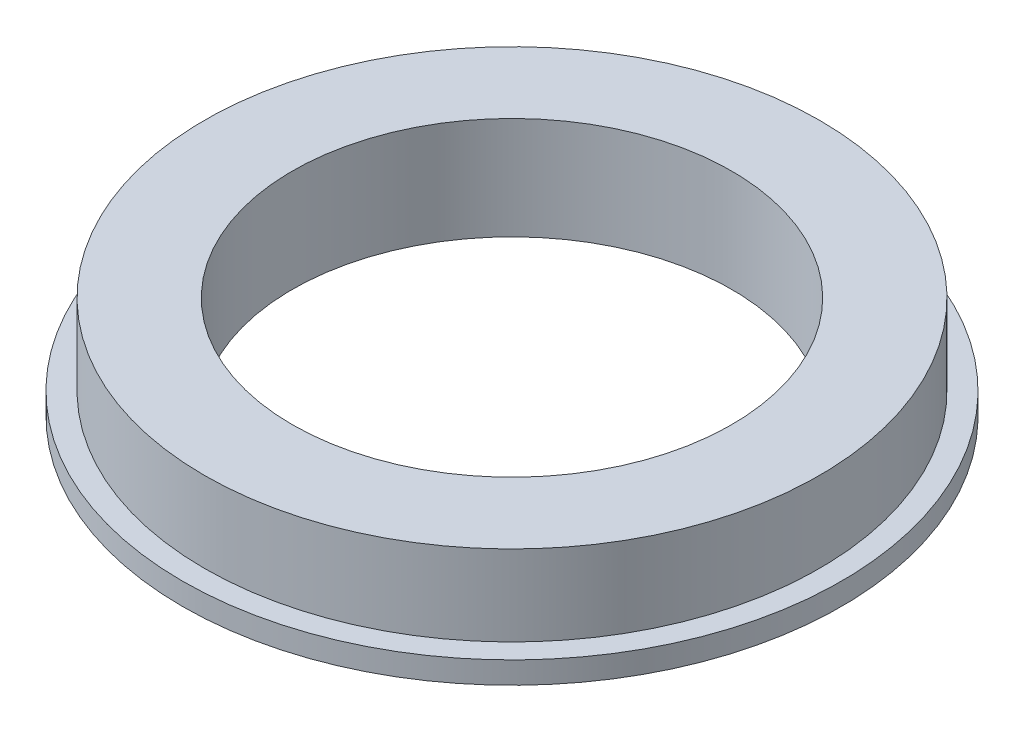
ISO-10303-21;
HEADER;
FILE_DESCRIPTION(('STEP AP214'),'2;1');
FILE_NAME('part.step','',(''),(''),'','','');
FILE_SCHEMA(('AUTOMOTIVE_DESIGN { 1 0 10303 214 1 1 1 1 }'));
ENDSEC;
DATA;
#1=APPLICATION_CONTEXT('core data for automotive mechanical design processes');
#2=APPLICATION_PROTOCOL_DEFINITION('international standard','automotive_design',2000,#1);
#3=PRODUCT_CONTEXT('',#1,'mechanical');
#4=PRODUCT('Part','Part','',(#3));
#5=PRODUCT_RELATED_PRODUCT_CATEGORY('part','',(#4));
#6=PRODUCT_DEFINITION_FORMATION('','',#4);
#7=PRODUCT_DEFINITION_CONTEXT('part definition',#1,'design');
#8=PRODUCT_DEFINITION('design','',#6,#7);
#9=PRODUCT_DEFINITION_SHAPE('','',#8);
#10=(LENGTH_UNIT() NAMED_UNIT(*) SI_UNIT(.MILLI.,.METRE.));
#11=(NAMED_UNIT(*) PLANE_ANGLE_UNIT() SI_UNIT($,.RADIAN.));
#12=(NAMED_UNIT(*) SI_UNIT($,.STERADIAN.) SOLID_ANGLE_UNIT());
#13=UNCERTAINTY_MEASURE_WITH_UNIT(LENGTH_MEASURE(1.E-05),#10,'distance_accuracy_value','');
#14=(GEOMETRIC_REPRESENTATION_CONTEXT(3) GLOBAL_UNCERTAINTY_ASSIGNED_CONTEXT((#13)) GLOBAL_UNIT_ASSIGNED_CONTEXT((#10,
#11,#12)) REPRESENTATION_CONTEXT('',''));
#15=CARTESIAN_POINT('',(0.,0.,0.));
#16=DIRECTION('',(0.,0.,1.));
#17=DIRECTION('',(1.,0.,0.));
#18=AXIS2_PLACEMENT_3D('',#15,#16,#17);
#19=CARTESIAN_POINT('',(0.,1.5,0.));
#20=DIRECTION('',(0.,-1.,0.));
#21=DIRECTION('',(0.,0.,-1.));
#22=AXIS2_PLACEMENT_3D('',#19,#20,#21);
#23=CYLINDRICAL_SURFACE('',#22,22.5);
#24=CARTESIAN_POINT('',(0.,1.5,0.));
#25=DIRECTION('',(0.,1.,0.));
#26=DIRECTION('',(0.,0.,1.));
#27=AXIS2_PLACEMENT_3D('',#24,#25,#26);
#28=CIRCLE('',#27,22.5);
#29=CARTESIAN_POINT('',(0.,1.5,22.5));
#30=VERTEX_POINT('',#29);
#31=EDGE_CURVE('E10',#30,#30,#28,.T.);
#32=ORIENTED_EDGE('',*,*,#31,.F.);
#33=EDGE_LOOP('',(#32));
#34=FACE_BOUND('',#33,.T.);
#35=CARTESIAN_POINT('',(0.,0.,0.));
#36=DIRECTION('',(0.,1.,0.));
#37=DIRECTION('',(0.,0.,1.));
#38=AXIS2_PLACEMENT_3D('',#35,#36,#37);
#39=CIRCLE('',#38,22.5);
#40=CARTESIAN_POINT('',(0.,0.,22.5));
#41=VERTEX_POINT('',#40);
#42=EDGE_CURVE('E36',#41,#41,#39,.T.);
#43=ORIENTED_EDGE('',*,*,#42,.T.);
#44=EDGE_LOOP('',(#43));
#45=FACE_BOUND('',#44,.T.);
#46=ADVANCED_FACE('F33',(#34,#45),#23,.T.);
#47=CARTESIAN_POINT('',(0.,1.5,0.));
#48=DIRECTION('',(0.,1.,0.));
#49=DIRECTION('',(0.,0.,1.));
#50=AXIS2_PLACEMENT_3D('',#47,#48,#49);
#51=PLANE('',#50);
#52=CARTESIAN_POINT('',(0.,1.5,0.));
#53=DIRECTION('',(0.,1.,0.));
#54=DIRECTION('',(0.,0.,1.));
#55=AXIS2_PLACEMENT_3D('',#52,#53,#54);
#56=CIRCLE('',#55,21.);
#57=CARTESIAN_POINT('',(0.,1.5,21.));
#58=VERTEX_POINT('',#57);
#59=EDGE_CURVE('E45',#58,#58,#56,.T.);
#60=ORIENTED_EDGE('',*,*,#59,.F.);
#61=EDGE_LOOP('',(#60));
#62=FACE_BOUND('',#61,.T.);
#63=ORIENTED_EDGE('',*,*,#31,.T.);
#64=EDGE_LOOP('',(#63));
#65=FACE_BOUND('',#64,.T.);
#66=ADVANCED_FACE('F78',(#62,#65),#51,.T.);
#67=CARTESIAN_POINT('',(0.,0.,0.));
#68=DIRECTION('',(0.,1.,0.));
#69=DIRECTION('',(0.,0.,1.));
#70=AXIS2_PLACEMENT_3D('',#67,#68,#69);
#71=PLANE('',#70);
#72=CARTESIAN_POINT('',(0.,0.,0.));
#73=DIRECTION('',(0.,1.,0.));
#74=DIRECTION('',(0.,0.,1.));
#75=AXIS2_PLACEMENT_3D('',#72,#73,#74);
#76=CIRCLE('',#75,15.);
#77=CARTESIAN_POINT('',(0.,0.,15.));
#78=VERTEX_POINT('',#77);
#79=EDGE_CURVE('E48',#78,#78,#76,.T.);
#80=ORIENTED_EDGE('',*,*,#79,.T.);
#81=EDGE_LOOP('',(#80));
#82=FACE_BOUND('',#81,.T.);
#83=ORIENTED_EDGE('',*,*,#42,.F.);
#84=EDGE_LOOP('',(#83));
#85=FACE_BOUND('',#84,.T.);
#86=ADVANCED_FACE('F57',(#82,#85),#71,.F.);
#87=CARTESIAN_POINT('',(0.,7.,0.));
#88=DIRECTION('',(0.,-1.,0.));
#89=DIRECTION('',(0.,0.,-1.));
#90=AXIS2_PLACEMENT_3D('',#87,#88,#89);
#91=CYLINDRICAL_SURFACE('',#90,21.);
#92=CARTESIAN_POINT('',(0.,7.,0.));
#93=DIRECTION('',(0.,1.,0.));
#94=DIRECTION('',(0.,0.,1.));
#95=AXIS2_PLACEMENT_3D('',#92,#93,#94);
#96=CIRCLE('',#95,21.);
#97=CARTESIAN_POINT('',(0.,7.,21.));
#98=VERTEX_POINT('',#97);
#99=EDGE_CURVE('E43',#98,#98,#96,.T.);
#100=ORIENTED_EDGE('',*,*,#99,.F.);
#101=EDGE_LOOP('',(#100));
#102=FACE_BOUND('',#101,.T.);
#103=ORIENTED_EDGE('',*,*,#59,.T.);
#104=EDGE_LOOP('',(#103));
#105=FACE_BOUND('',#104,.T.);
#106=ADVANCED_FACE('F69',(#102,#105),#91,.T.);
#107=CARTESIAN_POINT('',(0.,7.,0.));
#108=DIRECTION('',(0.,1.,0.));
#109=DIRECTION('',(0.,0.,1.));
#110=AXIS2_PLACEMENT_3D('',#107,#108,#109);
#111=PLANE('',#110);
#112=CARTESIAN_POINT('',(0.,7.,0.));
#113=DIRECTION('',(0.,1.,0.));
#114=DIRECTION('',(0.,0.,1.));
#115=AXIS2_PLACEMENT_3D('',#112,#113,#114);
#116=CIRCLE('',#115,15.);
#117=CARTESIAN_POINT('',(0.,7.,15.));
#118=VERTEX_POINT('',#117);
#119=EDGE_CURVE('E51',#118,#118,#116,.T.);
#120=ORIENTED_EDGE('',*,*,#119,.F.);
#121=EDGE_LOOP('',(#120));
#122=FACE_BOUND('',#121,.T.);
#123=ORIENTED_EDGE('',*,*,#99,.T.);
#124=EDGE_LOOP('',(#123));
#125=FACE_BOUND('',#124,.T.);
#126=ADVANCED_FACE('F63',(#122,#125),#111,.T.);
#127=CARTESIAN_POINT('',(0.,0.,0.));
#128=DIRECTION('',(0.,1.,0.));
#129=DIRECTION('',(0.,0.,1.));
#130=AXIS2_PLACEMENT_3D('',#127,#128,#129);
#131=CYLINDRICAL_SURFACE('',#130,15.);
#132=ORIENTED_EDGE('',*,*,#79,.F.);
#133=EDGE_LOOP('',(#132));
#134=FACE_BOUND('',#133,.T.);
#135=ORIENTED_EDGE('',*,*,#119,.T.);
#136=EDGE_LOOP('',(#135));
#137=FACE_BOUND('',#136,.T.);
#138=ADVANCED_FACE('F60',(#134,#137),#131,.F.);
#139=CLOSED_SHELL('',(#46,#66,#86,#106,#126,#138));
#140=MANIFOLD_SOLID_BREP('B2',#139);
#141=ADVANCED_BREP_SHAPE_REPRESENTATION('',(#18,#140),#14);
#142=SHAPE_DEFINITION_REPRESENTATION(#9,#141);
ENDSEC;
END-ISO-10303-21;
